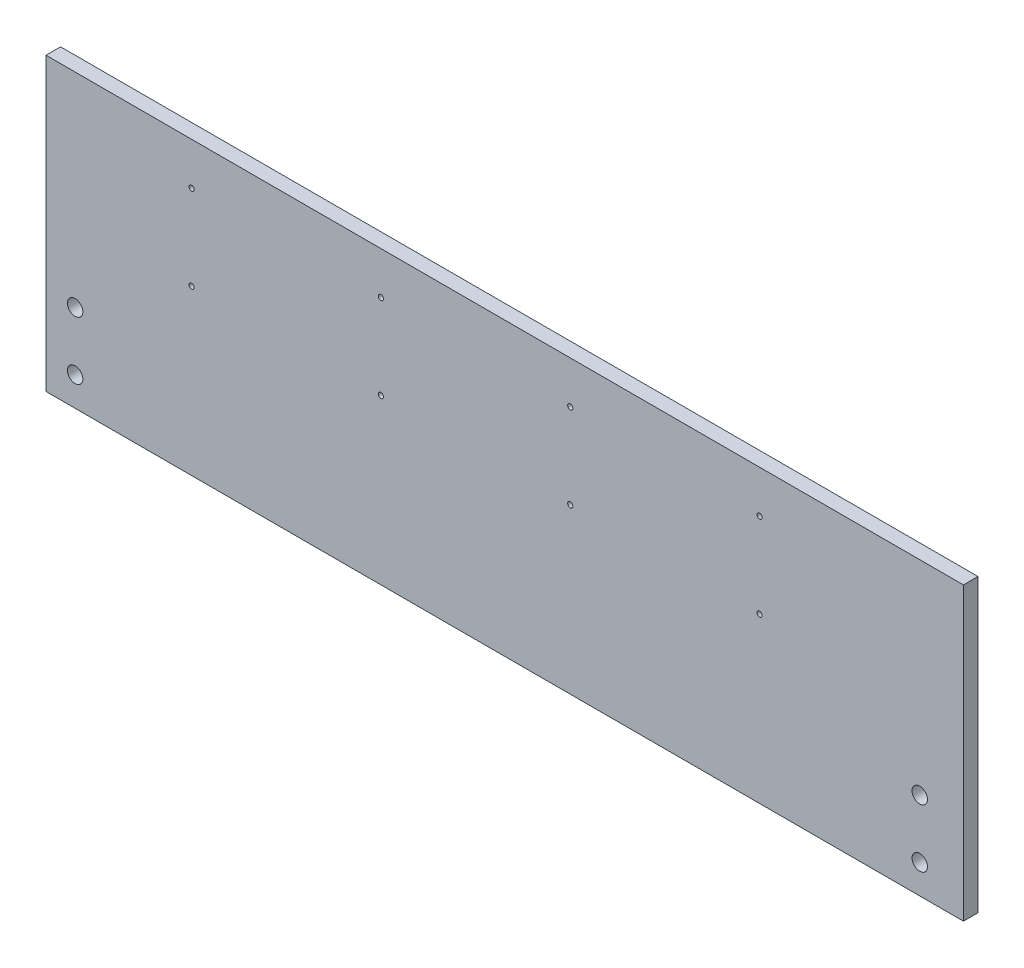
ISO-10303-21;
HEADER;
FILE_DESCRIPTION(('STEP AP214'),'2;1');
FILE_NAME('part.step','',(''),(''),'','','');
FILE_SCHEMA(('AUTOMOTIVE_DESIGN { 1 0 10303 214 1 1 1 1 }'));
ENDSEC;
DATA;
#1=APPLICATION_CONTEXT('core data for automotive mechanical design processes');
#2=APPLICATION_PROTOCOL_DEFINITION('international standard','automotive_design',2000,#1);
#3=PRODUCT_CONTEXT('',#1,'mechanical');
#4=PRODUCT('Part','Part','',(#3));
#5=PRODUCT_RELATED_PRODUCT_CATEGORY('part','',(#4));
#6=PRODUCT_DEFINITION_FORMATION('','',#4);
#7=PRODUCT_DEFINITION_CONTEXT('part definition',#1,'design');
#8=PRODUCT_DEFINITION('design','',#6,#7);
#9=PRODUCT_DEFINITION_SHAPE('','',#8);
#10=(LENGTH_UNIT() NAMED_UNIT(*) SI_UNIT(.MILLI.,.METRE.));
#11=(NAMED_UNIT(*) PLANE_ANGLE_UNIT() SI_UNIT($,.RADIAN.));
#12=(NAMED_UNIT(*) SI_UNIT($,.STERADIAN.) SOLID_ANGLE_UNIT());
#13=UNCERTAINTY_MEASURE_WITH_UNIT(LENGTH_MEASURE(1.E-05),#10,'distance_accuracy_value','');
#14=(GEOMETRIC_REPRESENTATION_CONTEXT(3) GLOBAL_UNCERTAINTY_ASSIGNED_CONTEXT((#13)) GLOBAL_UNIT_ASSIGNED_CONTEXT((#10,
#11,#12)) REPRESENTATION_CONTEXT('',''));
#15=CARTESIAN_POINT('',(0.,0.,0.));
#16=DIRECTION('',(0.,0.,1.));
#17=DIRECTION('',(1.,0.,0.));
#18=AXIS2_PLACEMENT_3D('',#15,#16,#17);
#19=CARTESIAN_POINT('',(0.,0.,0.));
#20=DIRECTION('',(0.,0.,-1.));
#21=DIRECTION('',(-1.,0.,0.));
#22=AXIS2_PLACEMENT_3D('',#19,#20,#21);
#23=PLANE('',#22);
#24=DIRECTION('',(0.,1.,0.));
#25=VECTOR('',#24,1.);
#26=CARTESIAN_POINT('',(200.025,-63.5,0.));
#27=LINE('',#26,#25);
#28=CARTESIAN_POINT('',(200.025,-63.5,0.));
#29=VERTEX_POINT('',#28);
#30=CARTESIAN_POINT('',(200.025,63.5,0.));
#31=VERTEX_POINT('',#30);
#32=EDGE_CURVE('E112',#29,#31,#27,.T.);
#33=ORIENTED_EDGE('',*,*,#32,.F.);
#34=DIRECTION('',(1.,0.,0.));
#35=VECTOR('',#34,1.);
#36=CARTESIAN_POINT('',(-200.025,-63.5,0.));
#37=LINE('',#36,#35);
#38=CARTESIAN_POINT('',(-200.025,-63.5,0.));
#39=VERTEX_POINT('',#38);
#40=EDGE_CURVE('E88',#39,#29,#37,.T.);
#41=ORIENTED_EDGE('',*,*,#40,.F.);
#42=DIRECTION('',(0.,-1.,0.));
#43=VECTOR('',#42,1.);
#44=CARTESIAN_POINT('',(-200.025,-63.5,0.));
#45=LINE('',#44,#43);
#46=CARTESIAN_POINT('',(-200.025,63.5,0.));
#47=VERTEX_POINT('',#46);
#48=EDGE_CURVE('E82',#47,#39,#45,.T.);
#49=ORIENTED_EDGE('',*,*,#48,.F.);
#50=DIRECTION('',(-1.,0.,0.));
#51=VECTOR('',#50,1.);
#52=CARTESIAN_POINT('',(-200.025,63.5,0.));
#53=LINE('',#52,#51);
#54=EDGE_CURVE('E104',#31,#47,#53,.T.);
#55=ORIENTED_EDGE('',*,*,#54,.F.);
#56=EDGE_LOOP('',(#33,#41,#49,#55));
#57=FACE_BOUND('',#56,.T.);
#58=CARTESIAN_POINT('',(180.975,-50.8,0.));
#59=DIRECTION('',(0.,0.,-1.));
#60=DIRECTION('',(-1.,0.,0.));
#61=AXIS2_PLACEMENT_3D('',#58,#59,#60);
#62=CIRCLE('',#61,3.36549999999999);
#63=CARTESIAN_POINT('',(177.6095,-50.8,0.));
#64=VERTEX_POINT('',#63);
#65=EDGE_CURVE('E126',#64,#64,#62,.T.);
#66=ORIENTED_EDGE('',*,*,#65,.F.);
#67=EDGE_LOOP('',(#66));
#68=FACE_BOUND('',#67,.T.);
#69=CARTESIAN_POINT('',(-187.325,-25.4,0.));
#70=DIRECTION('',(0.,0.,-1.));
#71=DIRECTION('',(-1.,0.,0.));
#72=AXIS2_PLACEMENT_3D('',#69,#70,#71);
#73=CIRCLE('',#72,3.36549999999999);
#74=CARTESIAN_POINT('',(-190.6905,-25.4,0.));
#75=VERTEX_POINT('',#74);
#76=EDGE_CURVE('E136',#75,#75,#73,.T.);
#77=ORIENTED_EDGE('',*,*,#76,.F.);
#78=EDGE_LOOP('',(#77));
#79=FACE_BOUND('',#78,.T.);
#80=CARTESIAN_POINT('',(-187.325,-50.8,0.));
#81=DIRECTION('',(0.,0.,-1.));
#82=DIRECTION('',(-1.,0.,0.));
#83=AXIS2_PLACEMENT_3D('',#80,#81,#82);
#84=CIRCLE('',#83,3.36549999999999);
#85=CARTESIAN_POINT('',(-190.6905,-50.8,0.));
#86=VERTEX_POINT('',#85);
#87=EDGE_CURVE('E135',#86,#86,#84,.T.);
#88=ORIENTED_EDGE('',*,*,#87,.F.);
#89=EDGE_LOOP('',(#88));
#90=FACE_BOUND('',#89,.T.);
#91=CARTESIAN_POINT('',(180.975,-25.4,0.));
#92=DIRECTION('',(0.,0.,-1.));
#93=DIRECTION('',(-1.,0.,0.));
#94=AXIS2_PLACEMENT_3D('',#91,#92,#93);
#95=CIRCLE('',#94,3.36549999999999);
#96=CARTESIAN_POINT('',(177.6095,-25.4,0.));
#97=VERTEX_POINT('',#96);
#98=EDGE_CURVE('E129',#97,#97,#95,.T.);
#99=ORIENTED_EDGE('',*,*,#98,.F.);
#100=EDGE_LOOP('',(#99));
#101=FACE_BOUND('',#100,.T.);
#102=CARTESIAN_POINT('',(111.125,8.02499999999928,0.));
#103=DIRECTION('',(0.,0.,1.));
#104=DIRECTION('',(1.,0.,0.));
#105=AXIS2_PLACEMENT_3D('',#102,#103,#104);
#106=CIRCLE('',#105,1.1303);
#107=CARTESIAN_POINT('',(112.2553,8.02499999999928,0.));
#108=VERTEX_POINT('',#107);
#109=EDGE_CURVE('E147',#108,#108,#106,.T.);
#110=ORIENTED_EDGE('',*,*,#109,.T.);
#111=EDGE_LOOP('',(#110));
#112=FACE_BOUND('',#111,.T.);
#113=CARTESIAN_POINT('',(111.125,45.0249999999993,0.));
#114=DIRECTION('',(0.,0.,1.));
#115=DIRECTION('',(1.,0.,0.));
#116=AXIS2_PLACEMENT_3D('',#113,#114,#115);
#117=CIRCLE('',#116,1.1303);
#118=CARTESIAN_POINT('',(112.2553,45.0249999999993,0.));
#119=VERTEX_POINT('',#118);
#120=EDGE_CURVE('E155',#119,#119,#117,.T.);
#121=ORIENTED_EDGE('',*,*,#120,.T.);
#122=EDGE_LOOP('',(#121));
#123=FACE_BOUND('',#122,.T.);
#124=CARTESIAN_POINT('',(28.575,8.02500000000007,0.));
#125=DIRECTION('',(0.,0.,1.));
#126=DIRECTION('',(1.,0.,0.));
#127=AXIS2_PLACEMENT_3D('',#124,#125,#126);
#128=CIRCLE('',#127,1.1303);
#129=CARTESIAN_POINT('',(29.7053,8.02500000000007,0.));
#130=VERTEX_POINT('',#129);
#131=EDGE_CURVE('E161',#130,#130,#128,.T.);
#132=ORIENTED_EDGE('',*,*,#131,.T.);
#133=EDGE_LOOP('',(#132));
#134=FACE_BOUND('',#133,.T.);
#135=CARTESIAN_POINT('',(28.575,45.0250000000001,0.));
#136=DIRECTION('',(0.,0.,1.));
#137=DIRECTION('',(1.,0.,0.));
#138=AXIS2_PLACEMENT_3D('',#135,#136,#137);
#139=CIRCLE('',#138,1.1303);
#140=CARTESIAN_POINT('',(29.7053,45.0250000000001,0.));
#141=VERTEX_POINT('',#140);
#142=EDGE_CURVE('E167',#141,#141,#139,.T.);
#143=ORIENTED_EDGE('',*,*,#142,.T.);
#144=EDGE_LOOP('',(#143));
#145=FACE_BOUND('',#144,.T.);
#146=CARTESIAN_POINT('',(-53.9749999999998,8.0250000000005,0.));
#147=DIRECTION('',(0.,0.,1.));
#148=DIRECTION('',(1.,0.,0.));
#149=AXIS2_PLACEMENT_3D('',#146,#147,#148);
#150=CIRCLE('',#149,1.1303);
#151=CARTESIAN_POINT('',(-52.8446999999998,8.0250000000005,0.));
#152=VERTEX_POINT('',#151);
#153=EDGE_CURVE('E173',#152,#152,#150,.T.);
#154=ORIENTED_EDGE('',*,*,#153,.T.);
#155=EDGE_LOOP('',(#154));
#156=FACE_BOUND('',#155,.T.);
#157=CARTESIAN_POINT('',(-53.9749999999998,45.0250000000005,0.));
#158=DIRECTION('',(0.,0.,1.));
#159=DIRECTION('',(1.,0.,0.));
#160=AXIS2_PLACEMENT_3D('',#157,#158,#159);
#161=CIRCLE('',#160,1.1303);
#162=CARTESIAN_POINT('',(-52.8446999999998,45.0250000000005,0.));
#163=VERTEX_POINT('',#162);
#164=EDGE_CURVE('E179',#163,#163,#161,.T.);
#165=ORIENTED_EDGE('',*,*,#164,.T.);
#166=EDGE_LOOP('',(#165));
#167=FACE_BOUND('',#166,.T.);
#168=CARTESIAN_POINT('',(-136.525,8.02500000000135,0.));
#169=DIRECTION('',(0.,0.,1.));
#170=DIRECTION('',(1.,0.,0.));
#171=AXIS2_PLACEMENT_3D('',#168,#169,#170);
#172=CIRCLE('',#171,1.1303);
#173=CARTESIAN_POINT('',(-135.3947,8.02500000000135,0.));
#174=VERTEX_POINT('',#173);
#175=EDGE_CURVE('E185',#174,#174,#172,.T.);
#176=ORIENTED_EDGE('',*,*,#175,.T.);
#177=EDGE_LOOP('',(#176));
#178=FACE_BOUND('',#177,.T.);
#179=CARTESIAN_POINT('',(-136.525,45.0250000000014,0.));
#180=DIRECTION('',(0.,0.,1.));
#181=DIRECTION('',(1.,0.,0.));
#182=AXIS2_PLACEMENT_3D('',#179,#180,#181);
#183=CIRCLE('',#182,1.1303);
#184=CARTESIAN_POINT('',(-135.3947,45.0250000000014,0.));
#185=VERTEX_POINT('',#184);
#186=EDGE_CURVE('E191',#185,#185,#183,.T.);
#187=ORIENTED_EDGE('',*,*,#186,.T.);
#188=EDGE_LOOP('',(#187));
#189=FACE_BOUND('',#188,.T.);
#190=ADVANCED_FACE('F48',(#57,#68,#79,#90,#101,#112,#123,#134,#145,#156,#167,#178,#189),#23,.T.);
#191=CARTESIAN_POINT('',(200.025,-63.5,6.35));
#192=DIRECTION('',(-1.,0.,0.));
#193=DIRECTION('',(0.,0.,1.));
#194=AXIS2_PLACEMENT_3D('',#191,#192,#193);
#195=PLANE('',#194);
#196=ORIENTED_EDGE('',*,*,#32,.T.);
#197=DIRECTION('',(0.,0.,-1.));
#198=VECTOR('',#197,1.);
#199=CARTESIAN_POINT('',(200.025,63.5,6.35));
#200=LINE('',#199,#198);
#201=CARTESIAN_POINT('',(200.025,63.5,6.35));
#202=VERTEX_POINT('',#201);
#203=EDGE_CURVE('E11',#202,#31,#200,.T.);
#204=ORIENTED_EDGE('',*,*,#203,.F.);
#205=DIRECTION('',(0.,1.,0.));
#206=VECTOR('',#205,1.);
#207=CARTESIAN_POINT('',(200.025,-63.5,6.35));
#208=LINE('',#207,#206);
#209=CARTESIAN_POINT('',(200.025,-63.5,6.35));
#210=VERTEX_POINT('',#209);
#211=EDGE_CURVE('E100',#210,#202,#208,.T.);
#212=ORIENTED_EDGE('',*,*,#211,.F.);
#213=DIRECTION('',(0.,0.,-1.));
#214=VECTOR('',#213,1.);
#215=CARTESIAN_POINT('',(200.025,-63.5,6.35));
#216=LINE('',#215,#214);
#217=EDGE_CURVE('E108',#210,#29,#216,.T.);
#218=ORIENTED_EDGE('',*,*,#217,.T.);
#219=EDGE_LOOP('',(#196,#204,#212,#218));
#220=FACE_BOUND('',#219,.T.);
#221=ADVANCED_FACE('F50',(#220),#195,.F.);
#222=CARTESIAN_POINT('',(-200.025,63.5,6.35));
#223=DIRECTION('',(0.,-1.,0.));
#224=DIRECTION('',(0.,0.,-1.));
#225=AXIS2_PLACEMENT_3D('',#222,#223,#224);
#226=PLANE('',#225);
#227=ORIENTED_EDGE('',*,*,#54,.T.);
#228=DIRECTION('',(0.,0.,-1.));
#229=VECTOR('',#228,1.);
#230=CARTESIAN_POINT('',(-200.025,63.5,6.35));
#231=LINE('',#230,#229);
#232=CARTESIAN_POINT('',(-200.025,63.5,6.35));
#233=VERTEX_POINT('',#232);
#234=EDGE_CURVE('E57',#233,#47,#231,.T.);
#235=ORIENTED_EDGE('',*,*,#234,.F.);
#236=DIRECTION('',(-1.,0.,0.));
#237=VECTOR('',#236,1.);
#238=CARTESIAN_POINT('',(-200.025,63.5,6.35));
#239=LINE('',#238,#237);
#240=EDGE_CURVE('E95',#202,#233,#239,.T.);
#241=ORIENTED_EDGE('',*,*,#240,.F.);
#242=ORIENTED_EDGE('',*,*,#203,.T.);
#243=EDGE_LOOP('',(#227,#235,#241,#242));
#244=FACE_BOUND('',#243,.T.);
#245=ADVANCED_FACE('F103',(#244),#226,.F.);
#246=CARTESIAN_POINT('',(-200.025,-63.5,6.35));
#247=DIRECTION('',(1.,0.,0.));
#248=DIRECTION('',(0.,0.,-1.));
#249=AXIS2_PLACEMENT_3D('',#246,#247,#248);
#250=PLANE('',#249);
#251=ORIENTED_EDGE('',*,*,#48,.T.);
#252=DIRECTION('',(0.,0.,-1.));
#253=VECTOR('',#252,1.);
#254=CARTESIAN_POINT('',(-200.025,-63.5,6.35));
#255=LINE('',#254,#253);
#256=CARTESIAN_POINT('',(-200.025,-63.5,6.35));
#257=VERTEX_POINT('',#256);
#258=EDGE_CURVE('E105',#257,#39,#255,.T.);
#259=ORIENTED_EDGE('',*,*,#258,.F.);
#260=DIRECTION('',(0.,-1.,0.));
#261=VECTOR('',#260,1.);
#262=CARTESIAN_POINT('',(-200.025,-63.5,6.35));
#263=LINE('',#262,#261);
#264=EDGE_CURVE('E98',#233,#257,#263,.T.);
#265=ORIENTED_EDGE('',*,*,#264,.F.);
#266=ORIENTED_EDGE('',*,*,#234,.T.);
#267=EDGE_LOOP('',(#251,#259,#265,#266));
#268=FACE_BOUND('',#267,.T.);
#269=ADVANCED_FACE('F106',(#268),#250,.F.);
#270=CARTESIAN_POINT('',(-200.025,-63.5,6.35));
#271=DIRECTION('',(0.,1.,0.));
#272=DIRECTION('',(0.,0.,1.));
#273=AXIS2_PLACEMENT_3D('',#270,#271,#272);
#274=PLANE('',#273);
#275=ORIENTED_EDGE('',*,*,#40,.T.);
#276=ORIENTED_EDGE('',*,*,#217,.F.);
#277=DIRECTION('',(1.,0.,0.));
#278=VECTOR('',#277,1.);
#279=CARTESIAN_POINT('',(-200.025,-63.5,6.35));
#280=LINE('',#279,#278);
#281=EDGE_CURVE('E65',#257,#210,#280,.T.);
#282=ORIENTED_EDGE('',*,*,#281,.F.);
#283=ORIENTED_EDGE('',*,*,#258,.T.);
#284=EDGE_LOOP('',(#275,#276,#282,#283));
#285=FACE_BOUND('',#284,.T.);
#286=ADVANCED_FACE('F120',(#285),#274,.F.);
#287=CARTESIAN_POINT('',(0.,0.,6.35));
#288=DIRECTION('',(0.,0.,-1.));
#289=DIRECTION('',(-1.,0.,0.));
#290=AXIS2_PLACEMENT_3D('',#287,#288,#289);
#291=PLANE('',#290);
#292=CARTESIAN_POINT('',(-136.525,45.0250000000014,6.35));
#293=DIRECTION('',(0.,0.,1.));
#294=DIRECTION('',(1.,0.,0.));
#295=AXIS2_PLACEMENT_3D('',#292,#293,#294);
#296=CIRCLE('',#295,1.1303);
#297=CARTESIAN_POINT('',(-135.3947,45.0250000000014,6.35));
#298=VERTEX_POINT('',#297);
#299=EDGE_CURVE('E194',#298,#298,#296,.T.);
#300=ORIENTED_EDGE('',*,*,#299,.F.);
#301=EDGE_LOOP('',(#300));
#302=FACE_BOUND('',#301,.T.);
#303=CARTESIAN_POINT('',(-136.525,8.02500000000135,6.35));
#304=DIRECTION('',(0.,0.,1.));
#305=DIRECTION('',(1.,0.,0.));
#306=AXIS2_PLACEMENT_3D('',#303,#304,#305);
#307=CIRCLE('',#306,1.1303);
#308=CARTESIAN_POINT('',(-135.3947,8.02500000000135,6.35));
#309=VERTEX_POINT('',#308);
#310=EDGE_CURVE('E188',#309,#309,#307,.T.);
#311=ORIENTED_EDGE('',*,*,#310,.F.);
#312=EDGE_LOOP('',(#311));
#313=FACE_BOUND('',#312,.T.);
#314=CARTESIAN_POINT('',(-53.9749999999998,45.0250000000005,6.35));
#315=DIRECTION('',(0.,0.,1.));
#316=DIRECTION('',(1.,0.,0.));
#317=AXIS2_PLACEMENT_3D('',#314,#315,#316);
#318=CIRCLE('',#317,1.1303);
#319=CARTESIAN_POINT('',(-52.8446999999998,45.0250000000005,6.35));
#320=VERTEX_POINT('',#319);
#321=EDGE_CURVE('E182',#320,#320,#318,.T.);
#322=ORIENTED_EDGE('',*,*,#321,.F.);
#323=EDGE_LOOP('',(#322));
#324=FACE_BOUND('',#323,.T.);
#325=CARTESIAN_POINT('',(-53.9749999999998,8.0250000000005,6.35));
#326=DIRECTION('',(0.,0.,1.));
#327=DIRECTION('',(1.,0.,0.));
#328=AXIS2_PLACEMENT_3D('',#325,#326,#327);
#329=CIRCLE('',#328,1.1303);
#330=CARTESIAN_POINT('',(-52.8446999999998,8.0250000000005,6.35));
#331=VERTEX_POINT('',#330);
#332=EDGE_CURVE('E176',#331,#331,#329,.T.);
#333=ORIENTED_EDGE('',*,*,#332,.F.);
#334=EDGE_LOOP('',(#333));
#335=FACE_BOUND('',#334,.T.);
#336=CARTESIAN_POINT('',(28.575,45.0250000000001,6.35));
#337=DIRECTION('',(0.,0.,1.));
#338=DIRECTION('',(1.,0.,0.));
#339=AXIS2_PLACEMENT_3D('',#336,#337,#338);
#340=CIRCLE('',#339,1.1303);
#341=CARTESIAN_POINT('',(29.7053,45.0250000000001,6.35));
#342=VERTEX_POINT('',#341);
#343=EDGE_CURVE('E170',#342,#342,#340,.T.);
#344=ORIENTED_EDGE('',*,*,#343,.F.);
#345=EDGE_LOOP('',(#344));
#346=FACE_BOUND('',#345,.T.);
#347=CARTESIAN_POINT('',(28.575,8.02500000000007,6.35));
#348=DIRECTION('',(0.,0.,1.));
#349=DIRECTION('',(1.,0.,0.));
#350=AXIS2_PLACEMENT_3D('',#347,#348,#349);
#351=CIRCLE('',#350,1.1303);
#352=CARTESIAN_POINT('',(29.7053,8.02500000000007,6.35));
#353=VERTEX_POINT('',#352);
#354=EDGE_CURVE('E164',#353,#353,#351,.T.);
#355=ORIENTED_EDGE('',*,*,#354,.F.);
#356=EDGE_LOOP('',(#355));
#357=FACE_BOUND('',#356,.T.);
#358=CARTESIAN_POINT('',(111.125,45.0249999999993,6.35));
#359=DIRECTION('',(0.,0.,1.));
#360=DIRECTION('',(1.,0.,0.));
#361=AXIS2_PLACEMENT_3D('',#358,#359,#360);
#362=CIRCLE('',#361,1.1303);
#363=CARTESIAN_POINT('',(112.2553,45.0249999999993,6.35));
#364=VERTEX_POINT('',#363);
#365=EDGE_CURVE('E158',#364,#364,#362,.T.);
#366=ORIENTED_EDGE('',*,*,#365,.F.);
#367=EDGE_LOOP('',(#366));
#368=FACE_BOUND('',#367,.T.);
#369=CARTESIAN_POINT('',(111.125,8.02499999999928,6.35));
#370=DIRECTION('',(0.,0.,1.));
#371=DIRECTION('',(1.,0.,0.));
#372=AXIS2_PLACEMENT_3D('',#369,#370,#371);
#373=CIRCLE('',#372,1.1303);
#374=CARTESIAN_POINT('',(112.2553,8.02499999999928,6.35));
#375=VERTEX_POINT('',#374);
#376=EDGE_CURVE('E152',#375,#375,#373,.T.);
#377=ORIENTED_EDGE('',*,*,#376,.F.);
#378=EDGE_LOOP('',(#377));
#379=FACE_BOUND('',#378,.T.);
#380=CARTESIAN_POINT('',(180.975,-25.4,6.35));
#381=DIRECTION('',(0.,0.,-1.));
#382=DIRECTION('',(-1.,0.,0.));
#383=AXIS2_PLACEMENT_3D('',#380,#381,#382);
#384=CIRCLE('',#383,3.36549999999999);
#385=CARTESIAN_POINT('',(177.6095,-25.4,6.35));
#386=VERTEX_POINT('',#385);
#387=EDGE_CURVE('E139',#386,#386,#384,.T.);
#388=ORIENTED_EDGE('',*,*,#387,.T.);
#389=EDGE_LOOP('',(#388));
#390=FACE_BOUND('',#389,.T.);
#391=CARTESIAN_POINT('',(-187.325,-50.8,6.35));
#392=DIRECTION('',(0.,0.,-1.));
#393=DIRECTION('',(-1.,0.,0.));
#394=AXIS2_PLACEMENT_3D('',#391,#392,#393);
#395=CIRCLE('',#394,3.36549999999999);
#396=CARTESIAN_POINT('',(-190.6905,-50.8,6.35));
#397=VERTEX_POINT('',#396);
#398=EDGE_CURVE('E132',#397,#397,#395,.T.);
#399=ORIENTED_EDGE('',*,*,#398,.T.);
#400=EDGE_LOOP('',(#399));
#401=FACE_BOUND('',#400,.T.);
#402=CARTESIAN_POINT('',(-187.325,-25.4,6.35));
#403=DIRECTION('',(0.,0.,-1.));
#404=DIRECTION('',(-1.,0.,0.));
#405=AXIS2_PLACEMENT_3D('',#402,#403,#404);
#406=CIRCLE('',#405,3.36549999999999);
#407=CARTESIAN_POINT('',(-190.6905,-25.4,6.35));
#408=VERTEX_POINT('',#407);
#409=EDGE_CURVE('E144',#408,#408,#406,.T.);
#410=ORIENTED_EDGE('',*,*,#409,.T.);
#411=EDGE_LOOP('',(#410));
#412=FACE_BOUND('',#411,.T.);
#413=CARTESIAN_POINT('',(180.975,-50.8,6.35));
#414=DIRECTION('',(0.,0.,-1.));
#415=DIRECTION('',(-1.,0.,0.));
#416=AXIS2_PLACEMENT_3D('',#413,#414,#415);
#417=CIRCLE('',#416,3.36549999999999);
#418=CARTESIAN_POINT('',(177.6095,-50.8,6.35));
#419=VERTEX_POINT('',#418);
#420=EDGE_CURVE('E115',#419,#419,#417,.T.);
#421=ORIENTED_EDGE('',*,*,#420,.T.);
#422=EDGE_LOOP('',(#421));
#423=FACE_BOUND('',#422,.T.);
#424=ORIENTED_EDGE('',*,*,#211,.T.);
#425=ORIENTED_EDGE('',*,*,#240,.T.);
#426=ORIENTED_EDGE('',*,*,#264,.T.);
#427=ORIENTED_EDGE('',*,*,#281,.T.);
#428=EDGE_LOOP('',(#424,#425,#426,#427));
#429=FACE_BOUND('',#428,.T.);
#430=ADVANCED_FACE('F96',(#302,#313,#324,#335,#346,#357,#368,#379,#390,#401,#412,#423,#429),
#291,.F.);
#431=CARTESIAN_POINT('',(180.975,-50.8,6.35));
#432=DIRECTION('',(0.,0.,-1.));
#433=DIRECTION('',(-1.,0.,0.));
#434=AXIS2_PLACEMENT_3D('',#431,#432,#433);
#435=CYLINDRICAL_SURFACE('',#434,3.36549999999999);
#436=ORIENTED_EDGE('',*,*,#420,.F.);
#437=EDGE_LOOP('',(#436));
#438=FACE_BOUND('',#437,.T.);
#439=ORIENTED_EDGE('',*,*,#65,.T.);
#440=EDGE_LOOP('',(#439));
#441=FACE_BOUND('',#440,.T.);
#442=ADVANCED_FACE('F202',(#438,#441),#435,.F.);
#443=CARTESIAN_POINT('',(-187.325,-25.4,6.35));
#444=DIRECTION('',(0.,0.,-1.));
#445=DIRECTION('',(-1.,0.,0.));
#446=AXIS2_PLACEMENT_3D('',#443,#444,#445);
#447=CYLINDRICAL_SURFACE('',#446,3.36549999999999);
#448=ORIENTED_EDGE('',*,*,#409,.F.);
#449=EDGE_LOOP('',(#448));
#450=FACE_BOUND('',#449,.T.);
#451=ORIENTED_EDGE('',*,*,#76,.T.);
#452=EDGE_LOOP('',(#451));
#453=FACE_BOUND('',#452,.T.);
#454=ADVANCED_FACE('F228',(#450,#453),#447,.F.);
#455=CARTESIAN_POINT('',(-187.325,-50.8,6.35));
#456=DIRECTION('',(0.,0.,-1.));
#457=DIRECTION('',(-1.,0.,0.));
#458=AXIS2_PLACEMENT_3D('',#455,#456,#457);
#459=CYLINDRICAL_SURFACE('',#458,3.36549999999999);
#460=ORIENTED_EDGE('',*,*,#398,.F.);
#461=EDGE_LOOP('',(#460));
#462=FACE_BOUND('',#461,.T.);
#463=ORIENTED_EDGE('',*,*,#87,.T.);
#464=EDGE_LOOP('',(#463));
#465=FACE_BOUND('',#464,.T.);
#466=ADVANCED_FACE('F292',(#462,#465),#459,.F.);
#467=CARTESIAN_POINT('',(180.975,-25.4,6.35));
#468=DIRECTION('',(0.,0.,-1.));
#469=DIRECTION('',(-1.,0.,0.));
#470=AXIS2_PLACEMENT_3D('',#467,#468,#469);
#471=CYLINDRICAL_SURFACE('',#470,3.36549999999999);
#472=ORIENTED_EDGE('',*,*,#387,.F.);
#473=EDGE_LOOP('',(#472));
#474=FACE_BOUND('',#473,.T.);
#475=ORIENTED_EDGE('',*,*,#98,.T.);
#476=EDGE_LOOP('',(#475));
#477=FACE_BOUND('',#476,.T.);
#478=ADVANCED_FACE('F288',(#474,#477),#471,.F.);
#479=CARTESIAN_POINT('',(111.125,8.02499999999928,6.35));
#480=DIRECTION('',(0.,0.,1.));
#481=DIRECTION('',(1.,0.,0.));
#482=AXIS2_PLACEMENT_3D('',#479,#480,#481);
#483=CYLINDRICAL_SURFACE('',#482,1.1303);
#484=ORIENTED_EDGE('',*,*,#109,.F.);
#485=EDGE_LOOP('',(#484));
#486=FACE_BOUND('',#485,.T.);
#487=ORIENTED_EDGE('',*,*,#376,.T.);
#488=EDGE_LOOP('',(#487));
#489=FACE_BOUND('',#488,.T.);
#490=ADVANCED_FACE('F284',(#486,#489),#483,.F.);
#491=CARTESIAN_POINT('',(111.125,45.0249999999993,6.35));
#492=DIRECTION('',(0.,0.,1.));
#493=DIRECTION('',(1.,0.,0.));
#494=AXIS2_PLACEMENT_3D('',#491,#492,#493);
#495=CYLINDRICAL_SURFACE('',#494,1.1303);
#496=ORIENTED_EDGE('',*,*,#120,.F.);
#497=EDGE_LOOP('',(#496));
#498=FACE_BOUND('',#497,.T.);
#499=ORIENTED_EDGE('',*,*,#365,.T.);
#500=EDGE_LOOP('',(#499));
#501=FACE_BOUND('',#500,.T.);
#502=ADVANCED_FACE('F280',(#498,#501),#495,.F.);
#503=CARTESIAN_POINT('',(28.575,8.02500000000007,6.35));
#504=DIRECTION('',(0.,0.,1.));
#505=DIRECTION('',(1.,0.,0.));
#506=AXIS2_PLACEMENT_3D('',#503,#504,#505);
#507=CYLINDRICAL_SURFACE('',#506,1.1303);
#508=ORIENTED_EDGE('',*,*,#131,.F.);
#509=EDGE_LOOP('',(#508));
#510=FACE_BOUND('',#509,.T.);
#511=ORIENTED_EDGE('',*,*,#354,.T.);
#512=EDGE_LOOP('',(#511));
#513=FACE_BOUND('',#512,.T.);
#514=ADVANCED_FACE('F276',(#510,#513),#507,.F.);
#515=CARTESIAN_POINT('',(28.575,45.0250000000001,6.35));
#516=DIRECTION('',(0.,0.,1.));
#517=DIRECTION('',(1.,0.,0.));
#518=AXIS2_PLACEMENT_3D('',#515,#516,#517);
#519=CYLINDRICAL_SURFACE('',#518,1.1303);
#520=ORIENTED_EDGE('',*,*,#142,.F.);
#521=EDGE_LOOP('',(#520));
#522=FACE_BOUND('',#521,.T.);
#523=ORIENTED_EDGE('',*,*,#343,.T.);
#524=EDGE_LOOP('',(#523));
#525=FACE_BOUND('',#524,.T.);
#526=ADVANCED_FACE('F272',(#522,#525),#519,.F.);
#527=CARTESIAN_POINT('',(-53.9749999999998,8.0250000000005,6.35));
#528=DIRECTION('',(0.,0.,1.));
#529=DIRECTION('',(1.,0.,0.));
#530=AXIS2_PLACEMENT_3D('',#527,#528,#529);
#531=CYLINDRICAL_SURFACE('',#530,1.1303);
#532=ORIENTED_EDGE('',*,*,#153,.F.);
#533=EDGE_LOOP('',(#532));
#534=FACE_BOUND('',#533,.T.);
#535=ORIENTED_EDGE('',*,*,#332,.T.);
#536=EDGE_LOOP('',(#535));
#537=FACE_BOUND('',#536,.T.);
#538=ADVANCED_FACE('F268',(#534,#537),#531,.F.);
#539=CARTESIAN_POINT('',(-53.9749999999998,45.0250000000005,6.35));
#540=DIRECTION('',(0.,0.,1.));
#541=DIRECTION('',(1.,0.,0.));
#542=AXIS2_PLACEMENT_3D('',#539,#540,#541);
#543=CYLINDRICAL_SURFACE('',#542,1.1303);
#544=ORIENTED_EDGE('',*,*,#164,.F.);
#545=EDGE_LOOP('',(#544));
#546=FACE_BOUND('',#545,.T.);
#547=ORIENTED_EDGE('',*,*,#321,.T.);
#548=EDGE_LOOP('',(#547));
#549=FACE_BOUND('',#548,.T.);
#550=ADVANCED_FACE('F262',(#546,#549),#543,.F.);
#551=CARTESIAN_POINT('',(-136.525,8.02500000000135,6.35));
#552=DIRECTION('',(0.,0.,1.));
#553=DIRECTION('',(1.,0.,0.));
#554=AXIS2_PLACEMENT_3D('',#551,#552,#553);
#555=CYLINDRICAL_SURFACE('',#554,1.1303);
#556=ORIENTED_EDGE('',*,*,#175,.F.);
#557=EDGE_LOOP('',(#556));
#558=FACE_BOUND('',#557,.T.);
#559=ORIENTED_EDGE('',*,*,#310,.T.);
#560=EDGE_LOOP('',(#559));
#561=FACE_BOUND('',#560,.T.);
#562=ADVANCED_FACE('F257',(#558,#561),#555,.F.);
#563=CARTESIAN_POINT('',(-136.525,45.0250000000014,6.35));
#564=DIRECTION('',(0.,0.,1.));
#565=DIRECTION('',(1.,0.,0.));
#566=AXIS2_PLACEMENT_3D('',#563,#564,#565);
#567=CYLINDRICAL_SURFACE('',#566,1.1303);
#568=ORIENTED_EDGE('',*,*,#186,.F.);
#569=EDGE_LOOP('',(#568));
#570=FACE_BOUND('',#569,.T.);
#571=ORIENTED_EDGE('',*,*,#299,.T.);
#572=EDGE_LOOP('',(#571));
#573=FACE_BOUND('',#572,.T.);
#574=ADVANCED_FACE('F198',(#570,#573),#567,.F.);
#575=CLOSED_SHELL('',(#190,#221,#245,#269,#286,#430,#442,#454,#466,#478,#490,#502,#514,#526,
#538,#550,#562,#574));
#576=MANIFOLD_SOLID_BREP('B2',#575);
#577=ADVANCED_BREP_SHAPE_REPRESENTATION('',(#18,#576),#14);
#578=SHAPE_DEFINITION_REPRESENTATION(#9,#577);
ENDSEC;
END-ISO-10303-21;
